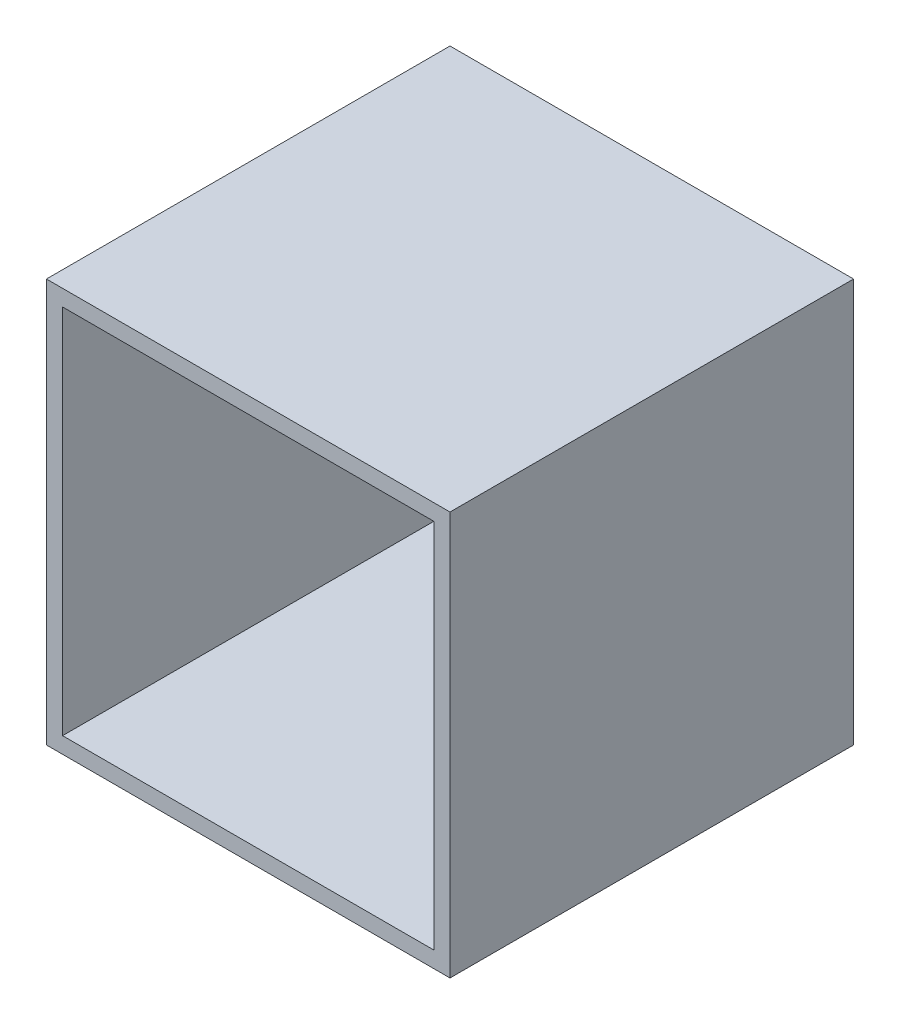
ISO-10303-21;
HEADER;
FILE_DESCRIPTION(('STEP AP214'),'2;1');
FILE_NAME('part.step','',(''),(''),'','','');
FILE_SCHEMA(('AUTOMOTIVE_DESIGN { 1 0 10303 214 1 1 1 1 }'));
ENDSEC;
DATA;
#1=APPLICATION_CONTEXT('core data for automotive mechanical design processes');
#2=APPLICATION_PROTOCOL_DEFINITION('international standard','automotive_design',2000,#1);
#3=PRODUCT_CONTEXT('',#1,'mechanical');
#4=PRODUCT('Part','Part','',(#3));
#5=PRODUCT_RELATED_PRODUCT_CATEGORY('part','',(#4));
#6=PRODUCT_DEFINITION_FORMATION('','',#4);
#7=PRODUCT_DEFINITION_CONTEXT('part definition',#1,'design');
#8=PRODUCT_DEFINITION('design','',#6,#7);
#9=PRODUCT_DEFINITION_SHAPE('','',#8);
#10=(LENGTH_UNIT() NAMED_UNIT(*) SI_UNIT(.MILLI.,.METRE.));
#11=(NAMED_UNIT(*) PLANE_ANGLE_UNIT() SI_UNIT($,.RADIAN.));
#12=(NAMED_UNIT(*) SI_UNIT($,.STERADIAN.) SOLID_ANGLE_UNIT());
#13=UNCERTAINTY_MEASURE_WITH_UNIT(LENGTH_MEASURE(1.E-05),#10,'distance_accuracy_value','');
#14=(GEOMETRIC_REPRESENTATION_CONTEXT(3) GLOBAL_UNCERTAINTY_ASSIGNED_CONTEXT((#13)) GLOBAL_UNIT_ASSIGNED_CONTEXT((#10,
#11,#12)) REPRESENTATION_CONTEXT('',''));
#15=CARTESIAN_POINT('',(0.,0.,0.));
#16=DIRECTION('',(0.,0.,1.));
#17=DIRECTION('',(1.,0.,0.));
#18=AXIS2_PLACEMENT_3D('',#15,#16,#17);
#19=CARTESIAN_POINT('',(-5.,5.,0.4));
#20=DIRECTION('',(1.,0.,0.));
#21=DIRECTION('',(0.,0.,-1.));
#22=AXIS2_PLACEMENT_3D('',#19,#20,#21);
#23=PLANE('',#22);
#24=DIRECTION('',(0.,-1.,0.));
#25=VECTOR('',#24,1.);
#26=CARTESIAN_POINT('',(-5.,5.,0.));
#27=LINE('',#26,#25);
#28=CARTESIAN_POINT('',(-5.,5.,0.));
#29=VERTEX_POINT('',#28);
#30=CARTESIAN_POINT('',(-5.,-5.,0.));
#31=VERTEX_POINT('',#30);
#32=EDGE_CURVE('E144',#29,#31,#27,.T.);
#33=ORIENTED_EDGE('',*,*,#32,.T.);
#34=DIRECTION('',(0.,0.,-1.));
#35=VECTOR('',#34,1.);
#36=CARTESIAN_POINT('',(-5.,-5.,0.4));
#37=LINE('',#36,#35);
#38=CARTESIAN_POINT('',(-5.,-5.,10.));
#39=VERTEX_POINT('',#38);
#40=EDGE_CURVE('E11',#39,#31,#37,.T.);
#41=ORIENTED_EDGE('',*,*,#40,.F.);
#42=DIRECTION('',(0.,-1.,0.));
#43=VECTOR('',#42,1.);
#44=CARTESIAN_POINT('',(-5.,5.,10.));
#45=LINE('',#44,#43);
#46=CARTESIAN_POINT('',(-5.,5.,10.));
#47=VERTEX_POINT('',#46);
#48=EDGE_CURVE('E111',#47,#39,#45,.T.);
#49=ORIENTED_EDGE('',*,*,#48,.F.);
#50=DIRECTION('',(0.,0.,-1.));
#51=VECTOR('',#50,1.);
#52=CARTESIAN_POINT('',(-5.,5.,0.4));
#53=LINE('',#52,#51);
#54=EDGE_CURVE('E153',#47,#29,#53,.T.);
#55=ORIENTED_EDGE('',*,*,#54,.T.);
#56=EDGE_LOOP('',(#33,#41,#49,#55));
#57=FACE_BOUND('',#56,.T.);
#58=ADVANCED_FACE('F33',(#57),#23,.F.);
#59=CARTESIAN_POINT('',(-5.,-5.,0.4));
#60=DIRECTION('',(0.,1.,0.));
#61=DIRECTION('',(-1.,0.,0.));
#62=AXIS2_PLACEMENT_3D('',#59,#60,#61);
#63=PLANE('',#62);
#64=DIRECTION('',(1.,0.,0.));
#65=VECTOR('',#64,1.);
#66=CARTESIAN_POINT('',(-5.,-5.,0.));
#67=LINE('',#66,#65);
#68=CARTESIAN_POINT('',(5.,-5.,0.));
#69=VERTEX_POINT('',#68);
#70=EDGE_CURVE('E147',#31,#69,#67,.T.);
#71=ORIENTED_EDGE('',*,*,#70,.T.);
#72=DIRECTION('',(0.,0.,-1.));
#73=VECTOR('',#72,1.);
#74=CARTESIAN_POINT('',(5.,-5.,0.4));
#75=LINE('',#74,#73);
#76=CARTESIAN_POINT('',(5.,-5.,10.));
#77=VERTEX_POINT('',#76);
#78=EDGE_CURVE('E40',#77,#69,#75,.T.);
#79=ORIENTED_EDGE('',*,*,#78,.F.);
#80=DIRECTION('',(1.,0.,0.));
#81=VECTOR('',#80,1.);
#82=CARTESIAN_POINT('',(-5.,-5.,10.));
#83=LINE('',#82,#81);
#84=EDGE_CURVE('E135',#39,#77,#83,.T.);
#85=ORIENTED_EDGE('',*,*,#84,.F.);
#86=ORIENTED_EDGE('',*,*,#40,.T.);
#87=EDGE_LOOP('',(#71,#79,#85,#86));
#88=FACE_BOUND('',#87,.T.);
#89=ADVANCED_FACE('F175',(#88),#63,.F.);
#90=CARTESIAN_POINT('',(5.,5.,0.4));
#91=DIRECTION('',(-1.,0.,0.));
#92=DIRECTION('',(0.,0.,1.));
#93=AXIS2_PLACEMENT_3D('',#90,#91,#92);
#94=PLANE('',#93);
#95=DIRECTION('',(0.,1.,0.));
#96=VECTOR('',#95,1.);
#97=CARTESIAN_POINT('',(5.,5.,0.));
#98=LINE('',#97,#96);
#99=CARTESIAN_POINT('',(5.,5.,0.));
#100=VERTEX_POINT('',#99);
#101=EDGE_CURVE('E149',#69,#100,#98,.T.);
#102=ORIENTED_EDGE('',*,*,#101,.T.);
#103=DIRECTION('',(0.,0.,-1.));
#104=VECTOR('',#103,1.);
#105=CARTESIAN_POINT('',(5.,5.,0.4));
#106=LINE('',#105,#104);
#107=CARTESIAN_POINT('',(5.,5.,10.));
#108=VERTEX_POINT('',#107);
#109=EDGE_CURVE('E156',#108,#100,#106,.T.);
#110=ORIENTED_EDGE('',*,*,#109,.F.);
#111=DIRECTION('',(0.,1.,0.));
#112=VECTOR('',#111,1.);
#113=CARTESIAN_POINT('',(5.,5.,10.));
#114=LINE('',#113,#112);
#115=EDGE_CURVE('E138',#77,#108,#114,.T.);
#116=ORIENTED_EDGE('',*,*,#115,.F.);
#117=ORIENTED_EDGE('',*,*,#78,.T.);
#118=EDGE_LOOP('',(#102,#110,#116,#117));
#119=FACE_BOUND('',#118,.T.);
#120=ADVANCED_FACE('F162',(#119),#94,.F.);
#121=CARTESIAN_POINT('',(-5.,5.,0.4));
#122=DIRECTION('',(0.,-1.,0.));
#123=DIRECTION('',(1.,0.,0.));
#124=AXIS2_PLACEMENT_3D('',#121,#122,#123);
#125=PLANE('',#124);
#126=DIRECTION('',(-1.,0.,0.));
#127=VECTOR('',#126,1.);
#128=CARTESIAN_POINT('',(-5.,5.,0.));
#129=LINE('',#128,#127);
#130=EDGE_CURVE('E151',#100,#29,#129,.T.);
#131=ORIENTED_EDGE('',*,*,#130,.T.);
#132=ORIENTED_EDGE('',*,*,#54,.F.);
#133=DIRECTION('',(-1.,0.,0.));
#134=VECTOR('',#133,1.);
#135=CARTESIAN_POINT('',(-5.,5.,10.));
#136=LINE('',#135,#134);
#137=EDGE_CURVE('E141',#108,#47,#136,.T.);
#138=ORIENTED_EDGE('',*,*,#137,.F.);
#139=ORIENTED_EDGE('',*,*,#109,.T.);
#140=EDGE_LOOP('',(#131,#132,#138,#139));
#141=FACE_BOUND('',#140,.T.);
#142=ADVANCED_FACE('F170',(#141),#125,.F.);
#143=CARTESIAN_POINT('',(0.,0.,0.));
#144=DIRECTION('',(0.,0.,1.));
#145=DIRECTION('',(1.,0.,0.));
#146=AXIS2_PLACEMENT_3D('',#143,#144,#145);
#147=PLANE('',#146);
#148=ORIENTED_EDGE('',*,*,#32,.F.);
#149=ORIENTED_EDGE('',*,*,#130,.F.);
#150=ORIENTED_EDGE('',*,*,#101,.F.);
#151=ORIENTED_EDGE('',*,*,#70,.F.);
#152=EDGE_LOOP('',(#148,#149,#150,#151));
#153=FACE_BOUND('',#152,.T.);
#154=ADVANCED_FACE('F168',(#153),#147,.F.);
#155=CARTESIAN_POINT('',(0.,0.,10.));
#156=DIRECTION('',(0.,0.,1.));
#157=DIRECTION('',(1.,0.,0.));
#158=AXIS2_PLACEMENT_3D('',#155,#156,#157);
#159=PLANE('',#158);
#160=ORIENTED_EDGE('',*,*,#48,.T.);
#161=ORIENTED_EDGE('',*,*,#84,.T.);
#162=ORIENTED_EDGE('',*,*,#115,.T.);
#163=ORIENTED_EDGE('',*,*,#137,.T.);
#164=EDGE_LOOP('',(#160,#161,#162,#163));
#165=FACE_BOUND('',#164,.T.);
#166=DIRECTION('',(1.,0.,0.));
#167=VECTOR('',#166,1.);
#168=CARTESIAN_POINT('',(-4.6,-4.6,10.));
#169=LINE('',#168,#167);
#170=CARTESIAN_POINT('',(-4.6,-4.6,10.));
#171=VERTEX_POINT('',#170);
#172=CARTESIAN_POINT('',(4.6,-4.6,10.));
#173=VERTEX_POINT('',#172);
#174=EDGE_CURVE('E105',#171,#173,#169,.T.);
#175=ORIENTED_EDGE('',*,*,#174,.F.);
#176=DIRECTION('',(0.,-1.,0.));
#177=VECTOR('',#176,1.);
#178=CARTESIAN_POINT('',(-4.6,4.6,10.));
#179=LINE('',#178,#177);
#180=CARTESIAN_POINT('',(-4.6,4.6,10.));
#181=VERTEX_POINT('',#180);
#182=EDGE_CURVE('E96',#181,#171,#179,.T.);
#183=ORIENTED_EDGE('',*,*,#182,.F.);
#184=DIRECTION('',(-1.,0.,0.));
#185=VECTOR('',#184,1.);
#186=CARTESIAN_POINT('',(-4.6,4.6,10.));
#187=LINE('',#186,#185);
#188=CARTESIAN_POINT('',(4.6,4.6,10.));
#189=VERTEX_POINT('',#188);
#190=EDGE_CURVE('E119',#189,#181,#187,.T.);
#191=ORIENTED_EDGE('',*,*,#190,.F.);
#192=DIRECTION('',(0.,1.,0.));
#193=VECTOR('',#192,1.);
#194=CARTESIAN_POINT('',(4.6,4.6,10.));
#195=LINE('',#194,#193);
#196=EDGE_CURVE('E117',#173,#189,#195,.T.);
#197=ORIENTED_EDGE('',*,*,#196,.F.);
#198=EDGE_LOOP('',(#175,#183,#191,#197));
#199=FACE_BOUND('',#198,.T.);
#200=ADVANCED_FACE('F115',(#165,#199),#159,.T.);
#201=CARTESIAN_POINT('',(-4.6,4.6,10.));
#202=DIRECTION('',(1.,0.,0.));
#203=DIRECTION('',(0.,1.,0.));
#204=AXIS2_PLACEMENT_3D('',#201,#202,#203);
#205=PLANE('',#204);
#206=DIRECTION('',(0.,-1.,0.));
#207=VECTOR('',#206,1.);
#208=CARTESIAN_POINT('',(-4.6,4.6,0.4));
#209=LINE('',#208,#207);
#210=CARTESIAN_POINT('',(-4.6,4.6,0.4));
#211=VERTEX_POINT('',#210);
#212=CARTESIAN_POINT('',(-4.6,-4.6,0.4));
#213=VERTEX_POINT('',#212);
#214=EDGE_CURVE('E47',#211,#213,#209,.T.);
#215=ORIENTED_EDGE('',*,*,#214,.F.);
#216=DIRECTION('',(0.,0.,-1.));
#217=VECTOR('',#216,1.);
#218=CARTESIAN_POINT('',(-4.6,4.6,10.));
#219=LINE('',#218,#217);
#220=EDGE_CURVE('E101',#181,#211,#219,.T.);
#221=ORIENTED_EDGE('',*,*,#220,.F.);
#222=ORIENTED_EDGE('',*,*,#182,.T.);
#223=DIRECTION('',(0.,0.,-1.));
#224=VECTOR('',#223,1.);
#225=CARTESIAN_POINT('',(-4.6,-4.6,10.));
#226=LINE('',#225,#224);
#227=EDGE_CURVE('E99',#171,#213,#226,.T.);
#228=ORIENTED_EDGE('',*,*,#227,.T.);
#229=EDGE_LOOP('',(#215,#221,#222,#228));
#230=FACE_BOUND('',#229,.T.);
#231=ADVANCED_FACE('F98',(#230),#205,.T.);
#232=CARTESIAN_POINT('',(-4.6,-4.6,10.));
#233=DIRECTION('',(0.,1.,0.));
#234=DIRECTION('',(0.,0.,1.));
#235=AXIS2_PLACEMENT_3D('',#232,#233,#234);
#236=PLANE('',#235);
#237=DIRECTION('',(1.,0.,0.));
#238=VECTOR('',#237,1.);
#239=CARTESIAN_POINT('',(-4.6,-4.6,0.4));
#240=LINE('',#239,#238);
#241=CARTESIAN_POINT('',(4.6,-4.6,0.4));
#242=VERTEX_POINT('',#241);
#243=EDGE_CURVE('E51',#213,#242,#240,.T.);
#244=ORIENTED_EDGE('',*,*,#243,.F.);
#245=ORIENTED_EDGE('',*,*,#227,.F.);
#246=ORIENTED_EDGE('',*,*,#174,.T.);
#247=DIRECTION('',(0.,0.,-1.));
#248=VECTOR('',#247,1.);
#249=CARTESIAN_POINT('',(4.6,-4.6,10.));
#250=LINE('',#249,#248);
#251=EDGE_CURVE('E112',#173,#242,#250,.T.);
#252=ORIENTED_EDGE('',*,*,#251,.T.);
#253=EDGE_LOOP('',(#244,#245,#246,#252));
#254=FACE_BOUND('',#253,.T.);
#255=ADVANCED_FACE('F109',(#254),#236,.T.);
#256=CARTESIAN_POINT('',(4.6,4.6,10.));
#257=DIRECTION('',(-1.,0.,0.));
#258=DIRECTION('',(0.,-1.,0.));
#259=AXIS2_PLACEMENT_3D('',#256,#257,#258);
#260=PLANE('',#259);
#261=DIRECTION('',(0.,1.,0.));
#262=VECTOR('',#261,1.);
#263=CARTESIAN_POINT('',(4.6,4.6,0.4));
#264=LINE('',#263,#262);
#265=CARTESIAN_POINT('',(4.6,4.6,0.4));
#266=VERTEX_POINT('',#265);
#267=EDGE_CURVE('E125',#242,#266,#264,.T.);
#268=ORIENTED_EDGE('',*,*,#267,.F.);
#269=ORIENTED_EDGE('',*,*,#251,.F.);
#270=ORIENTED_EDGE('',*,*,#196,.T.);
#271=DIRECTION('',(0.,0.,-1.));
#272=VECTOR('',#271,1.);
#273=CARTESIAN_POINT('',(4.6,4.6,10.));
#274=LINE('',#273,#272);
#275=EDGE_CURVE('E129',#189,#266,#274,.T.);
#276=ORIENTED_EDGE('',*,*,#275,.T.);
#277=EDGE_LOOP('',(#268,#269,#270,#276));
#278=FACE_BOUND('',#277,.T.);
#279=ADVANCED_FACE('F197',(#278),#260,.T.);
#280=CARTESIAN_POINT('',(-4.6,4.6,10.));
#281=DIRECTION('',(0.,-1.,0.));
#282=DIRECTION('',(0.,0.,-1.));
#283=AXIS2_PLACEMENT_3D('',#280,#281,#282);
#284=PLANE('',#283);
#285=DIRECTION('',(-1.,0.,0.));
#286=VECTOR('',#285,1.);
#287=CARTESIAN_POINT('',(-4.6,4.6,0.4));
#288=LINE('',#287,#286);
#289=EDGE_CURVE('E106',#266,#211,#288,.T.);
#290=ORIENTED_EDGE('',*,*,#289,.F.);
#291=ORIENTED_EDGE('',*,*,#275,.F.);
#292=ORIENTED_EDGE('',*,*,#190,.T.);
#293=ORIENTED_EDGE('',*,*,#220,.T.);
#294=EDGE_LOOP('',(#290,#291,#292,#293));
#295=FACE_BOUND('',#294,.T.);
#296=ADVANCED_FACE('F190',(#295),#284,.T.);
#297=CARTESIAN_POINT('',(0.,0.,0.4));
#298=DIRECTION('',(0.,0.,1.));
#299=DIRECTION('',(1.,0.,0.));
#300=AXIS2_PLACEMENT_3D('',#297,#298,#299);
#301=PLANE('',#300);
#302=ORIENTED_EDGE('',*,*,#214,.T.);
#303=ORIENTED_EDGE('',*,*,#243,.T.);
#304=ORIENTED_EDGE('',*,*,#267,.T.);
#305=ORIENTED_EDGE('',*,*,#289,.T.);
#306=EDGE_LOOP('',(#302,#303,#304,#305));
#307=FACE_BOUND('',#306,.T.);
#308=ADVANCED_FACE('F187',(#307),#301,.T.);
#309=CLOSED_SHELL('',(#58,#89,#120,#142,#154,#200,#231,#255,#279,#296,#308));
#310=MANIFOLD_SOLID_BREP('B2',#309);
#311=ADVANCED_BREP_SHAPE_REPRESENTATION('',(#18,#310),#14);
#312=SHAPE_DEFINITION_REPRESENTATION(#9,#311);
ENDSEC;
END-ISO-10303-21;
